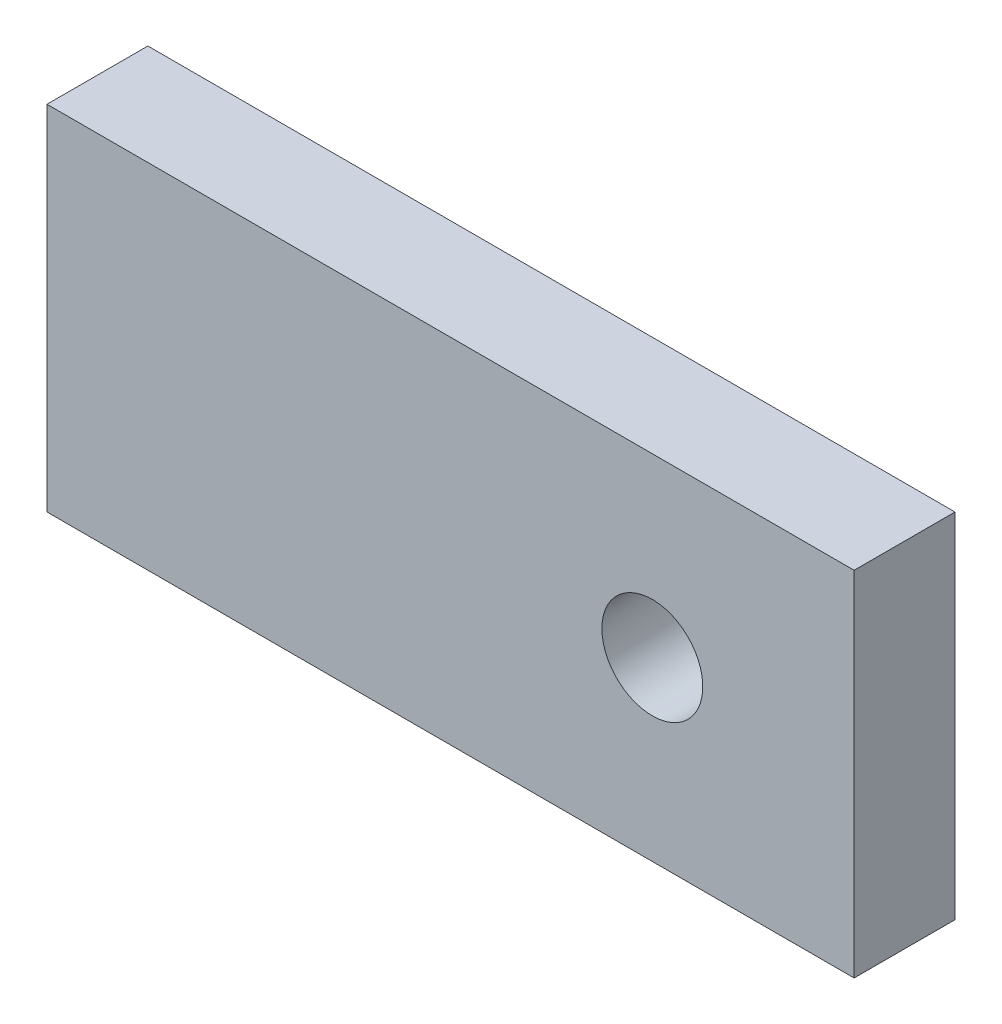
ISO-10303-21;
HEADER;
FILE_DESCRIPTION(('STEP AP214'),'2;1');
FILE_NAME('part.step','',(''),(''),'','','');
FILE_SCHEMA(('AUTOMOTIVE_DESIGN { 1 0 10303 214 1 1 1 1 }'));
ENDSEC;
DATA;
#1=APPLICATION_CONTEXT('core data for automotive mechanical design processes');
#2=APPLICATION_PROTOCOL_DEFINITION('international standard','automotive_design',2000,#1);
#3=PRODUCT_CONTEXT('',#1,'mechanical');
#4=PRODUCT('Part','Part','',(#3));
#5=PRODUCT_RELATED_PRODUCT_CATEGORY('part','',(#4));
#6=PRODUCT_DEFINITION_FORMATION('','',#4);
#7=PRODUCT_DEFINITION_CONTEXT('part definition',#1,'design');
#8=PRODUCT_DEFINITION('design','',#6,#7);
#9=PRODUCT_DEFINITION_SHAPE('','',#8);
#10=(LENGTH_UNIT() NAMED_UNIT(*) SI_UNIT(.MILLI.,.METRE.));
#11=(NAMED_UNIT(*) PLANE_ANGLE_UNIT() SI_UNIT($,.RADIAN.));
#12=(NAMED_UNIT(*) SI_UNIT($,.STERADIAN.) SOLID_ANGLE_UNIT());
#13=UNCERTAINTY_MEASURE_WITH_UNIT(LENGTH_MEASURE(1.E-05),#10,'distance_accuracy_value','');
#14=(GEOMETRIC_REPRESENTATION_CONTEXT(3) GLOBAL_UNCERTAINTY_ASSIGNED_CONTEXT((#13)) GLOBAL_UNIT_ASSIGNED_CONTEXT((#10,
#11,#12)) REPRESENTATION_CONTEXT('',''));
#15=CARTESIAN_POINT('',(0.,0.,0.));
#16=DIRECTION('',(0.,0.,1.));
#17=DIRECTION('',(1.,0.,0.));
#18=AXIS2_PLACEMENT_3D('',#15,#16,#17);
#19=CARTESIAN_POINT('',(-25.4,0.,6.35));
#20=DIRECTION('',(-1.,0.,0.));
#21=DIRECTION('',(0.,0.,1.));
#22=AXIS2_PLACEMENT_3D('',#19,#20,#21);
#23=PLANE('',#22);
#24=DIRECTION('',(0.,1.,0.));
#25=VECTOR('',#24,1.);
#26=CARTESIAN_POINT('',(-25.4,0.,0.));
#27=LINE('',#26,#25);
#28=CARTESIAN_POINT('',(-25.4,-11.1125,0.));
#29=VERTEX_POINT('',#28);
#30=CARTESIAN_POINT('',(-25.4,11.1125,0.));
#31=VERTEX_POINT('',#30);
#32=EDGE_CURVE('E108',#29,#31,#27,.T.);
#33=ORIENTED_EDGE('',*,*,#32,.F.);
#34=DIRECTION('',(0.,0.,-1.));
#35=VECTOR('',#34,1.);
#36=CARTESIAN_POINT('',(-25.4,-11.1125,6.35));
#37=LINE('',#36,#35);
#38=CARTESIAN_POINT('',(-25.4,-11.1125,6.35));
#39=VERTEX_POINT('',#38);
#40=EDGE_CURVE('E11',#39,#29,#37,.T.);
#41=ORIENTED_EDGE('',*,*,#40,.F.);
#42=DIRECTION('',(0.,1.,0.));
#43=VECTOR('',#42,1.);
#44=CARTESIAN_POINT('',(-25.4,0.,6.35));
#45=LINE('',#44,#43);
#46=CARTESIAN_POINT('',(-25.4,11.1125,6.35));
#47=VERTEX_POINT('',#46);
#48=EDGE_CURVE('E98',#39,#47,#45,.T.);
#49=ORIENTED_EDGE('',*,*,#48,.T.);
#50=DIRECTION('',(0.,0.,-1.));
#51=VECTOR('',#50,1.);
#52=CARTESIAN_POINT('',(-25.4,11.1125,6.35));
#53=LINE('',#52,#51);
#54=EDGE_CURVE('E77',#47,#31,#53,.T.);
#55=ORIENTED_EDGE('',*,*,#54,.T.);
#56=EDGE_LOOP('',(#33,#41,#49,#55));
#57=FACE_BOUND('',#56,.T.);
#58=ADVANCED_FACE('F38',(#57),#23,.T.);
#59=CARTESIAN_POINT('',(0.,-11.1125,6.35));
#60=DIRECTION('',(0.,-1.,0.));
#61=DIRECTION('',(1.,0.,0.));
#62=AXIS2_PLACEMENT_3D('',#59,#60,#61);
#63=PLANE('',#62);
#64=DIRECTION('',(-1.,0.,0.));
#65=VECTOR('',#64,1.);
#66=CARTESIAN_POINT('',(0.,-11.1125,0.));
#67=LINE('',#66,#65);
#68=CARTESIAN_POINT('',(25.4,-11.1125,0.));
#69=VERTEX_POINT('',#68);
#70=EDGE_CURVE('E90',#69,#29,#67,.T.);
#71=ORIENTED_EDGE('',*,*,#70,.F.);
#72=DIRECTION('',(0.,0.,-1.));
#73=VECTOR('',#72,1.);
#74=CARTESIAN_POINT('',(25.4,-11.1125,6.35));
#75=LINE('',#74,#73);
#76=CARTESIAN_POINT('',(25.4,-11.1125,6.35));
#77=VERTEX_POINT('',#76);
#78=EDGE_CURVE('E47',#77,#69,#75,.T.);
#79=ORIENTED_EDGE('',*,*,#78,.F.);
#80=DIRECTION('',(-1.,0.,0.));
#81=VECTOR('',#80,1.);
#82=CARTESIAN_POINT('',(0.,-11.1125,6.35));
#83=LINE('',#82,#81);
#84=EDGE_CURVE('E88',#77,#39,#83,.T.);
#85=ORIENTED_EDGE('',*,*,#84,.T.);
#86=ORIENTED_EDGE('',*,*,#40,.T.);
#87=EDGE_LOOP('',(#71,#79,#85,#86));
#88=FACE_BOUND('',#87,.T.);
#89=ADVANCED_FACE('F86',(#88),#63,.T.);
#90=CARTESIAN_POINT('',(25.4,0.,6.35));
#91=DIRECTION('',(-1.,0.,0.));
#92=DIRECTION('',(0.,0.,1.));
#93=AXIS2_PLACEMENT_3D('',#90,#91,#92);
#94=PLANE('',#93);
#95=DIRECTION('',(0.,1.,0.));
#96=VECTOR('',#95,1.);
#97=CARTESIAN_POINT('',(25.4,0.,0.));
#98=LINE('',#97,#96);
#99=CARTESIAN_POINT('',(25.4,11.1125,0.));
#100=VERTEX_POINT('',#99);
#101=EDGE_CURVE('E70',#69,#100,#98,.T.);
#102=ORIENTED_EDGE('',*,*,#101,.T.);
#103=DIRECTION('',(0.,0.,-1.));
#104=VECTOR('',#103,1.);
#105=CARTESIAN_POINT('',(25.4,11.1125,6.35));
#106=LINE('',#105,#104);
#107=CARTESIAN_POINT('',(25.4,11.1125,6.35));
#108=VERTEX_POINT('',#107);
#109=EDGE_CURVE('E92',#108,#100,#106,.T.);
#110=ORIENTED_EDGE('',*,*,#109,.F.);
#111=DIRECTION('',(0.,1.,0.));
#112=VECTOR('',#111,1.);
#113=CARTESIAN_POINT('',(25.4,0.,6.35));
#114=LINE('',#113,#112);
#115=EDGE_CURVE('E93',#77,#108,#114,.T.);
#116=ORIENTED_EDGE('',*,*,#115,.F.);
#117=ORIENTED_EDGE('',*,*,#78,.T.);
#118=EDGE_LOOP('',(#102,#110,#116,#117));
#119=FACE_BOUND('',#118,.T.);
#120=ADVANCED_FACE('F94',(#119),#94,.F.);
#121=CARTESIAN_POINT('',(0.,11.1125,6.35));
#122=DIRECTION('',(0.,-1.,0.));
#123=DIRECTION('',(1.,0.,0.));
#124=AXIS2_PLACEMENT_3D('',#121,#122,#123);
#125=PLANE('',#124);
#126=DIRECTION('',(-1.,0.,0.));
#127=VECTOR('',#126,1.);
#128=CARTESIAN_POINT('',(0.,11.1125,0.));
#129=LINE('',#128,#127);
#130=EDGE_CURVE('E102',#100,#31,#129,.T.);
#131=ORIENTED_EDGE('',*,*,#130,.T.);
#132=ORIENTED_EDGE('',*,*,#54,.F.);
#133=DIRECTION('',(-1.,0.,0.));
#134=VECTOR('',#133,1.);
#135=CARTESIAN_POINT('',(0.,11.1125,6.35));
#136=LINE('',#135,#134);
#137=EDGE_CURVE('E55',#108,#47,#136,.T.);
#138=ORIENTED_EDGE('',*,*,#137,.F.);
#139=ORIENTED_EDGE('',*,*,#109,.T.);
#140=EDGE_LOOP('',(#131,#132,#138,#139));
#141=FACE_BOUND('',#140,.T.);
#142=ADVANCED_FACE('F124',(#141),#125,.F.);
#143=CARTESIAN_POINT('',(0.,0.,6.35));
#144=DIRECTION('',(0.,0.,1.));
#145=DIRECTION('',(1.,0.,0.));
#146=AXIS2_PLACEMENT_3D('',#143,#144,#145);
#147=PLANE('',#146);
#148=CARTESIAN_POINT('',(12.7,0.,6.35));
#149=DIRECTION('',(0.,0.,-1.));
#150=DIRECTION('',(-1.,0.,0.));
#151=AXIS2_PLACEMENT_3D('',#148,#149,#150);
#152=CIRCLE('',#151,3.175);
#153=CARTESIAN_POINT('',(9.525,0.,6.35));
#154=VERTEX_POINT('',#153);
#155=EDGE_CURVE('E112',#154,#154,#152,.T.);
#156=ORIENTED_EDGE('',*,*,#155,.T.);
#157=EDGE_LOOP('',(#156));
#158=FACE_BOUND('',#157,.T.);
#159=ORIENTED_EDGE('',*,*,#48,.F.);
#160=ORIENTED_EDGE('',*,*,#84,.F.);
#161=ORIENTED_EDGE('',*,*,#115,.T.);
#162=ORIENTED_EDGE('',*,*,#137,.T.);
#163=EDGE_LOOP('',(#159,#160,#161,#162));
#164=FACE_BOUND('',#163,.T.);
#165=ADVANCED_FACE('F97',(#158,#164),#147,.T.);
#166=CARTESIAN_POINT('',(0.,0.,0.));
#167=DIRECTION('',(0.,0.,1.));
#168=DIRECTION('',(1.,0.,0.));
#169=AXIS2_PLACEMENT_3D('',#166,#167,#168);
#170=PLANE('',#169);
#171=CARTESIAN_POINT('',(12.7,0.,0.));
#172=DIRECTION('',(0.,0.,-1.));
#173=DIRECTION('',(-1.,0.,0.));
#174=AXIS2_PLACEMENT_3D('',#171,#172,#173);
#175=CIRCLE('',#174,3.175);
#176=CARTESIAN_POINT('',(9.525,0.,0.));
#177=VERTEX_POINT('',#176);
#178=EDGE_CURVE('E155',#177,#177,#175,.T.);
#179=ORIENTED_EDGE('',*,*,#178,.F.);
#180=EDGE_LOOP('',(#179));
#181=FACE_BOUND('',#180,.T.);
#182=ORIENTED_EDGE('',*,*,#32,.T.);
#183=ORIENTED_EDGE('',*,*,#130,.F.);
#184=ORIENTED_EDGE('',*,*,#101,.F.);
#185=ORIENTED_EDGE('',*,*,#70,.T.);
#186=EDGE_LOOP('',(#182,#183,#184,#185));
#187=FACE_BOUND('',#186,.T.);
#188=ADVANCED_FACE('F126',(#181,#187),#170,.F.);
#189=CARTESIAN_POINT('',(12.7,0.,0.));
#190=DIRECTION('',(0.,0.,-1.));
#191=DIRECTION('',(-1.,0.,0.));
#192=AXIS2_PLACEMENT_3D('',#189,#190,#191);
#193=CYLINDRICAL_SURFACE('',#192,3.175);
#194=ORIENTED_EDGE('',*,*,#155,.F.);
#195=EDGE_LOOP('',(#194));
#196=FACE_BOUND('',#195,.T.);
#197=ORIENTED_EDGE('',*,*,#178,.T.);
#198=EDGE_LOOP('',(#197));
#199=FACE_BOUND('',#198,.T.);
#200=ADVANCED_FACE('F140',(#196,#199),#193,.F.);
#201=CLOSED_SHELL('',(#58,#89,#120,#142,#165,#188,#200));
#202=MANIFOLD_SOLID_BREP('B2',#201);
#203=ADVANCED_BREP_SHAPE_REPRESENTATION('',(#18,#202),#14);
#204=SHAPE_DEFINITION_REPRESENTATION(#9,#203);
ENDSEC;
END-ISO-10303-21;
